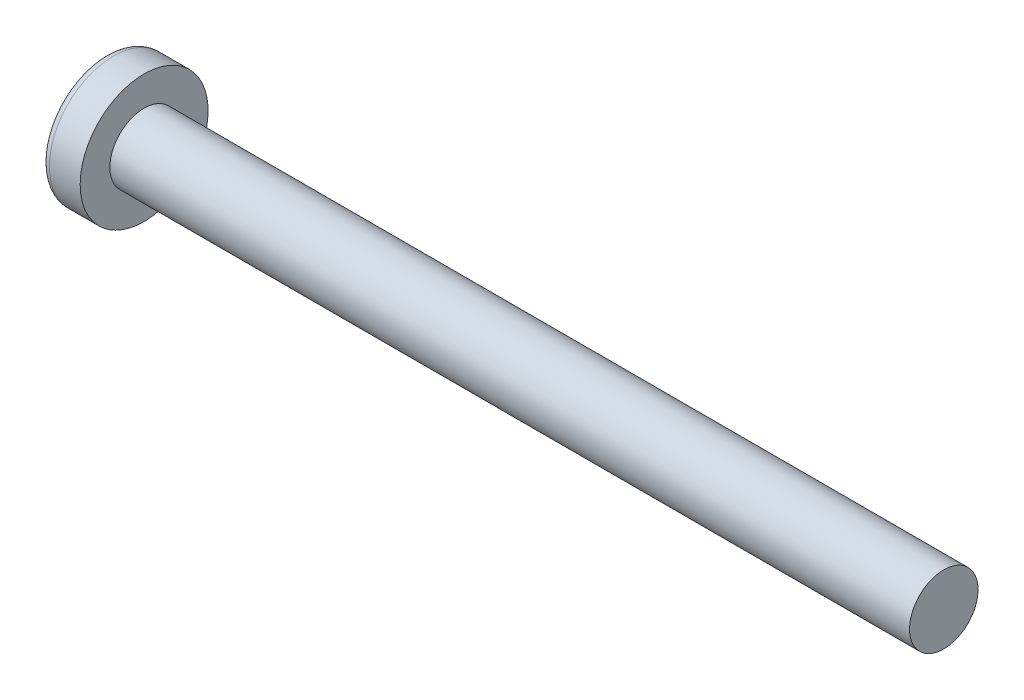
ISO-10303-21;
HEADER;
FILE_DESCRIPTION(('STEP AP214'),'2;1');
FILE_NAME('part.step','',(''),(''),'','','');
FILE_SCHEMA(('AUTOMOTIVE_DESIGN { 1 0 10303 214 1 1 1 1 }'));
ENDSEC;
DATA;
#1=APPLICATION_CONTEXT('core data for automotive mechanical design processes');
#2=APPLICATION_PROTOCOL_DEFINITION('international standard','automotive_design',2000,#1);
#3=PRODUCT_CONTEXT('',#1,'mechanical');
#4=PRODUCT('Part','Part','',(#3));
#5=PRODUCT_RELATED_PRODUCT_CATEGORY('part','',(#4));
#6=PRODUCT_DEFINITION_FORMATION('','',#4);
#7=PRODUCT_DEFINITION_CONTEXT('part definition',#1,'design');
#8=PRODUCT_DEFINITION('design','',#6,#7);
#9=PRODUCT_DEFINITION_SHAPE('','',#8);
#10=(LENGTH_UNIT() NAMED_UNIT(*) SI_UNIT(.MILLI.,.METRE.));
#11=(NAMED_UNIT(*) PLANE_ANGLE_UNIT() SI_UNIT($,.RADIAN.));
#12=(NAMED_UNIT(*) SI_UNIT($,.STERADIAN.) SOLID_ANGLE_UNIT());
#13=UNCERTAINTY_MEASURE_WITH_UNIT(LENGTH_MEASURE(1.E-05),#10,'distance_accuracy_value','');
#14=(GEOMETRIC_REPRESENTATION_CONTEXT(3) GLOBAL_UNCERTAINTY_ASSIGNED_CONTEXT((#13)) GLOBAL_UNIT_ASSIGNED_CONTEXT((#10,
#11,#12)) REPRESENTATION_CONTEXT('',''));
#15=CARTESIAN_POINT('',(0.,0.,0.));
#16=DIRECTION('',(0.,0.,1.));
#17=DIRECTION('',(1.,0.,0.));
#18=AXIS2_PLACEMENT_3D('',#15,#16,#17);
#19=CARTESIAN_POINT('',(5.,0.,0.));
#20=DIRECTION('',(-1.,0.,0.));
#21=DIRECTION('',(0.,1.,0.));
#22=AXIS2_PLACEMENT_3D('',#19,#20,#21);
#23=SPHERICAL_SURFACE('',#22,5.);
#24=CARTESIAN_POINT('',(0.74715070681048,0.,0.));
#25=DIRECTION('',(-1.,0.,0.));
#26=DIRECTION('',(0.,0.,1.));
#27=AXIS2_PLACEMENT_3D('',#24,#25,#26);
#28=CIRCLE('',#27,2.62931034482759);
#29=CARTESIAN_POINT('',(0.74715070681048,0.,2.62931034482759));
#30=VERTEX_POINT('',#29);
#31=EDGE_CURVE('E148',#30,#30,#28,.T.);
#32=ORIENTED_EDGE('',*,*,#31,.T.);
#33=EDGE_LOOP('',(#32));
#34=FACE_BOUND('',#33,.T.);
#35=CARTESIAN_POINT('',(4.98382636322272,-0.153868112043298,0.));
#36=DIRECTION('',(-0.104537710696287,-0.994520923380891,0.));
#37=DIRECTION('',(0.994520923380891,-0.104537710696287,0.));
#38=AXIS2_PLACEMENT_3D('',#35,#36,#37);
#39=CIRCLE('',#38,4.99760572850336);
#40=CARTESIAN_POINT('',(0.188596138461546,0.350175974082162,1.31444652548077));
#41=VERTEX_POINT('',#40);
#42=CARTESIAN_POINT('',(0.0270341343313624,0.367158343834486,0.367158343834487));
#43=VERTEX_POINT('',#42);
#44=EDGE_CURVE('E123',#41,#43,#39,.T.);
#45=ORIENTED_EDGE('',*,*,#44,.F.);
#46=CARTESIAN_POINT('',(3.98403090792016,0.,-1.41352221506761));
#47=DIRECTION('',(0.583636048152575,0.,0.812015371342713));
#48=DIRECTION('',(0.812015371342714,0.,-0.583636048152575));
#49=AXIS2_PLACEMENT_3D('',#46,#47,#48);
#50=CIRCLE('',#49,4.68719124331927);
#51=CARTESIAN_POINT('',(0.188596138461545,-0.350175974082172,1.31444652548076));
#52=VERTEX_POINT('',#51);
#53=EDGE_CURVE('E116',#41,#52,#50,.T.);
#54=ORIENTED_EDGE('',*,*,#53,.T.);
#55=CARTESIAN_POINT('',(4.98382636322272,0.153868112043297,0.));
#56=DIRECTION('',(-0.104537710696287,0.994520923380891,0.));
#57=DIRECTION('',(-0.994520923380891,-0.104537710696287,0.));
#58=AXIS2_PLACEMENT_3D('',#55,#56,#57);
#59=CIRCLE('',#58,4.99760572850336);
#60=CARTESIAN_POINT('',(0.0270341343313616,-0.367158343834489,0.367158343834487));
#61=VERTEX_POINT('',#60);
#62=EDGE_CURVE('E189',#61,#52,#59,.T.);
#63=ORIENTED_EDGE('',*,*,#62,.F.);
#64=CARTESIAN_POINT('',(4.98382636322272,0.,-0.153868112043297));
#65=DIRECTION('',(-0.104537710696287,0.,-0.994520923380891));
#66=DIRECTION('',(-0.994520923380891,0.,0.104537710696287));
#67=AXIS2_PLACEMENT_3D('',#64,#65,#66);
#68=CIRCLE('',#67,4.99760572850336);
#69=CARTESIAN_POINT('',(0.188596138461544,-1.31444652548077,0.350175974082167));
#70=VERTEX_POINT('',#69);
#71=EDGE_CURVE('E164',#70,#61,#68,.T.);
#72=ORIENTED_EDGE('',*,*,#71,.F.);
#73=CARTESIAN_POINT('',(3.98403090792015,1.41352221506761,0.));
#74=DIRECTION('',(0.583636048152575,-0.812015371342713,0.));
#75=DIRECTION('',(0.812015371342714,0.583636048152575,0.));
#76=AXIS2_PLACEMENT_3D('',#73,#74,#75);
#77=CIRCLE('',#76,4.68719124331927);
#78=CARTESIAN_POINT('',(0.188596138461544,-1.31444652548077,-0.350175974082167));
#79=VERTEX_POINT('',#78);
#80=EDGE_CURVE('E160',#70,#79,#77,.T.);
#81=ORIENTED_EDGE('',*,*,#80,.T.);
#82=CARTESIAN_POINT('',(4.98382636322272,0.,0.153868112043297));
#83=DIRECTION('',(-0.104537710696287,0.,0.994520923380891));
#84=DIRECTION('',(0.994520923380891,0.,0.104537710696287));
#85=AXIS2_PLACEMENT_3D('',#82,#83,#84);
#86=CIRCLE('',#85,4.99760572850336);
#87=CARTESIAN_POINT('',(0.0270341343313616,-0.367158343834486,-0.367158343834487));
#88=VERTEX_POINT('',#87);
#89=EDGE_CURVE('E44',#88,#79,#86,.T.);
#90=ORIENTED_EDGE('',*,*,#89,.F.);
#91=CARTESIAN_POINT('',(0.188596138461545,-0.350175974082162,-1.31444652548077));
#92=VERTEX_POINT('',#91);
#93=EDGE_CURVE('E186',#92,#88,#59,.T.);
#94=ORIENTED_EDGE('',*,*,#93,.F.);
#95=CARTESIAN_POINT('',(3.98403090792016,0.,1.41352221506761));
#96=DIRECTION('',(0.583636048152575,0.,-0.812015371342713));
#97=DIRECTION('',(-0.812015371342714,0.,-0.583636048152575));
#98=AXIS2_PLACEMENT_3D('',#95,#96,#97);
#99=CIRCLE('',#98,4.68719124331927);
#100=CARTESIAN_POINT('',(0.188596138461546,0.350175974082172,-1.31444652548076));
#101=VERTEX_POINT('',#100);
#102=EDGE_CURVE('E179',#92,#101,#99,.T.);
#103=ORIENTED_EDGE('',*,*,#102,.T.);
#104=CARTESIAN_POINT('',(0.0270341343313624,0.367158343834489,-0.367158343834487));
#105=VERTEX_POINT('',#104);
#106=EDGE_CURVE('E101',#105,#101,#39,.T.);
#107=ORIENTED_EDGE('',*,*,#106,.F.);
#108=CARTESIAN_POINT('',(0.188596138461546,1.31444652548076,-0.350175974082167));
#109=VERTEX_POINT('',#108);
#110=EDGE_CURVE('E37',#109,#105,#86,.T.);
#111=ORIENTED_EDGE('',*,*,#110,.F.);
#112=CARTESIAN_POINT('',(3.98403090792016,-1.41352221506761,0.));
#113=DIRECTION('',(0.583636048152575,0.812015371342713,0.));
#114=DIRECTION('',(-0.812015371342714,0.583636048152575,0.));
#115=AXIS2_PLACEMENT_3D('',#112,#113,#114);
#116=CIRCLE('',#115,4.68719124331927);
#117=CARTESIAN_POINT('',(0.188596138461546,1.31444652548076,0.350175974082167));
#118=VERTEX_POINT('',#117);
#119=EDGE_CURVE('E11',#109,#118,#116,.T.);
#120=ORIENTED_EDGE('',*,*,#119,.T.);
#121=EDGE_CURVE('E163',#43,#118,#68,.T.);
#122=ORIENTED_EDGE('',*,*,#121,.F.);
#123=EDGE_LOOP('',(#45,#54,#63,#72,#81,#90,#94,#103,#107,#111,#120,#122));
#124=FACE_BOUND('',#123,.T.);
#125=ADVANCED_FACE('F29',(#34,#124),#23,.T.);
#126=CARTESIAN_POINT('',(2.01739130434783,0.,-0.15794466403162));
#127=DIRECTION('',(-0.104537710696287,0.,0.994520923380891));
#128=DIRECTION('',(0.994520923380891,0.,0.104537710696287));
#129=AXIS2_PLACEMENT_3D('',#126,#127,#128);
#130=PLANE('',#129);
#131=ORIENTED_EDGE('',*,*,#110,.T.);
#132=DIRECTION('',(0.989130931836555,-0.103971149085093,0.103971149085092));
#133=VECTOR('',#132,1.);
#134=CARTESIAN_POINT('',(2.03363450411053,0.156237282238383,-0.156237282238382));
#135=LINE('',#134,#133);
#136=CARTESIAN_POINT('',(1.76,0.185000000000001,-0.184999999999999));
#137=VERTEX_POINT('',#136);
#138=EDGE_CURVE('E99',#105,#137,#135,.T.);
#139=ORIENTED_EDGE('',*,*,#138,.T.);
#140=DIRECTION('',(0.80907355338853,-0.581521616498006,0.0850446632823171));
#141=VECTOR('',#140,1.);
#142=CARTESIAN_POINT('',(0.,1.45,-0.37));
#143=LINE('',#142,#141);
#144=EDGE_CURVE('E121',#109,#137,#143,.T.);
#145=ORIENTED_EDGE('',*,*,#144,.F.);
#146=EDGE_LOOP('',(#131,#139,#145));
#147=FACE_BOUND('',#146,.T.);
#148=ADVANCED_FACE('F120',(#147),#130,.T.);
#149=DIRECTION('',(0.80907355338853,0.581521616498006,0.0850446632823171));
#150=VECTOR('',#149,1.);
#151=CARTESIAN_POINT('',(0.,-1.45,-0.37));
#152=LINE('',#151,#150);
#153=CARTESIAN_POINT('',(1.76,-0.185,-0.185));
#154=VERTEX_POINT('',#153);
#155=EDGE_CURVE('E142',#79,#154,#152,.T.);
#156=ORIENTED_EDGE('',*,*,#155,.T.);
#157=DIRECTION('',(-0.989130931836555,-0.103971149085092,-0.103971149085092));
#158=VECTOR('',#157,1.);
#159=CARTESIAN_POINT('',(2.03363450411053,-0.156237282238382,-0.156237282238382));
#160=LINE('',#159,#158);
#161=EDGE_CURVE('E187',#154,#88,#160,.T.);
#162=ORIENTED_EDGE('',*,*,#161,.T.);
#163=ORIENTED_EDGE('',*,*,#89,.T.);
#164=EDGE_LOOP('',(#156,#162,#163));
#165=FACE_BOUND('',#164,.T.);
#166=ADVANCED_FACE('F220',(#165),#130,.T.);
#167=CARTESIAN_POINT('',(2.01739130434783,0.,0.157944664031621));
#168=DIRECTION('',(-0.104537710696287,0.,-0.994520923380891));
#169=DIRECTION('',(-0.994520923380891,0.,0.104537710696287));
#170=AXIS2_PLACEMENT_3D('',#167,#168,#169);
#171=PLANE('',#170);
#172=DIRECTION('',(0.80907355338853,-0.581521616498006,-0.085044663282317));
#173=VECTOR('',#172,1.);
#174=CARTESIAN_POINT('',(0.,1.45,0.37));
#175=LINE('',#174,#173);
#176=CARTESIAN_POINT('',(1.76,0.185,0.185));
#177=VERTEX_POINT('',#176);
#178=EDGE_CURVE('E128',#118,#177,#175,.T.);
#179=ORIENTED_EDGE('',*,*,#178,.T.);
#180=DIRECTION('',(-0.989130931836555,0.103971149085092,0.103971149085092));
#181=VECTOR('',#180,1.);
#182=CARTESIAN_POINT('',(2.03363450411053,0.156237282238382,0.156237282238382));
#183=LINE('',#182,#181);
#184=EDGE_CURVE('E175',#177,#43,#183,.T.);
#185=ORIENTED_EDGE('',*,*,#184,.T.);
#186=ORIENTED_EDGE('',*,*,#121,.T.);
#187=EDGE_LOOP('',(#179,#185,#186));
#188=FACE_BOUND('',#187,.T.);
#189=ADVANCED_FACE('F173',(#188),#171,.T.);
#190=ORIENTED_EDGE('',*,*,#71,.T.);
#191=DIRECTION('',(0.989130931836555,0.103971149085093,-0.103971149085092));
#192=VECTOR('',#191,1.);
#193=CARTESIAN_POINT('',(2.03363450411053,-0.156237282238383,0.156237282238382));
#194=LINE('',#193,#192);
#195=CARTESIAN_POINT('',(1.76,-0.185000000000001,0.184999999999999));
#196=VERTEX_POINT('',#195);
#197=EDGE_CURVE('E192',#61,#196,#194,.T.);
#198=ORIENTED_EDGE('',*,*,#197,.T.);
#199=DIRECTION('',(0.80907355338853,0.581521616498006,-0.0850446632823169));
#200=VECTOR('',#199,1.);
#201=CARTESIAN_POINT('',(0.,-1.45,0.37));
#202=LINE('',#201,#200);
#203=EDGE_CURVE('E139',#70,#196,#202,.T.);
#204=ORIENTED_EDGE('',*,*,#203,.F.);
#205=EDGE_LOOP('',(#190,#198,#204));
#206=FACE_BOUND('',#205,.T.);
#207=ADVANCED_FACE('F239',(#206),#171,.T.);
#208=CARTESIAN_POINT('',(-25.4,0.,0.));
#209=DIRECTION('',(-1.,0.,0.));
#210=DIRECTION('',(0.,0.,1.));
#211=AXIS2_PLACEMENT_3D('',#208,#209,#210);
#212=CYLINDRICAL_SURFACE('',#211,1.5);
#213=CARTESIAN_POINT('',(37.4,0.,0.));
#214=DIRECTION('',(-1.,0.,0.));
#215=DIRECTION('',(0.,0.,1.));
#216=AXIS2_PLACEMENT_3D('',#213,#214,#215);
#217=CIRCLE('',#216,1.5);
#218=CARTESIAN_POINT('',(37.4,0.,1.5));
#219=VERTEX_POINT('',#218);
#220=EDGE_CURVE('E127',#219,#219,#217,.T.);
#221=ORIENTED_EDGE('',*,*,#220,.T.);
#222=EDGE_LOOP('',(#221));
#223=FACE_BOUND('',#222,.T.);
#224=CARTESIAN_POINT('',(2.4,0.,0.));
#225=DIRECTION('',(-1.,0.,0.));
#226=DIRECTION('',(0.,0.,1.));
#227=AXIS2_PLACEMENT_3D('',#224,#225,#226);
#228=CIRCLE('',#227,1.5);
#229=CARTESIAN_POINT('',(2.4,0.,1.5));
#230=VERTEX_POINT('',#229);
#231=EDGE_CURVE('E157',#230,#230,#228,.T.);
#232=ORIENTED_EDGE('',*,*,#231,.F.);
#233=EDGE_LOOP('',(#232));
#234=FACE_BOUND('',#233,.T.);
#235=ADVANCED_FACE('F31',(#223,#234),#212,.T.);
#236=CARTESIAN_POINT('',(2.4,1.5,0.));
#237=DIRECTION('',(-1.,0.,0.));
#238=DIRECTION('',(0.,0.,1.));
#239=AXIS2_PLACEMENT_3D('',#236,#237,#238);
#240=PLANE('',#239);
#241=CARTESIAN_POINT('',(2.4,0.,0.));
#242=DIRECTION('',(-1.,0.,0.));
#243=DIRECTION('',(0.,0.,1.));
#244=AXIS2_PLACEMENT_3D('',#241,#242,#243);
#245=CIRCLE('',#244,2.8);
#246=CARTESIAN_POINT('',(2.4,0.,2.8));
#247=VERTEX_POINT('',#246);
#248=EDGE_CURVE('E154',#247,#247,#245,.T.);
#249=ORIENTED_EDGE('',*,*,#248,.F.);
#250=EDGE_LOOP('',(#249));
#251=FACE_BOUND('',#250,.T.);
#252=ORIENTED_EDGE('',*,*,#231,.T.);
#253=EDGE_LOOP('',(#252));
#254=FACE_BOUND('',#253,.T.);
#255=ADVANCED_FACE('F232',(#251,#254),#240,.F.);
#256=CARTESIAN_POINT('',(-25.4,0.,0.));
#257=DIRECTION('',(-1.,0.,0.));
#258=DIRECTION('',(0.,0.,1.));
#259=AXIS2_PLACEMENT_3D('',#256,#257,#258);
#260=CYLINDRICAL_SURFACE('',#259,2.8);
#261=ORIENTED_EDGE('',*,*,#248,.T.);
#262=EDGE_LOOP('',(#261));
#263=FACE_BOUND('',#262,.T.);
#264=CARTESIAN_POINT('',(1.05335585592013,0.,0.));
#265=DIRECTION('',(-1.,0.,0.));
#266=DIRECTION('',(0.,0.,1.));
#267=AXIS2_PLACEMENT_3D('',#264,#265,#266);
#268=CIRCLE('',#267,2.8);
#269=CARTESIAN_POINT('',(1.05335585592013,0.,2.8));
#270=VERTEX_POINT('',#269);
#271=EDGE_CURVE('E151',#270,#270,#268,.T.);
#272=ORIENTED_EDGE('',*,*,#271,.F.);
#273=EDGE_LOOP('',(#272));
#274=FACE_BOUND('',#273,.T.);
#275=ADVANCED_FACE('F229',(#263,#274),#260,.T.);
#276=CARTESIAN_POINT('',(1.05335585592013,0.,0.));
#277=DIRECTION('',(-1.,0.,0.));
#278=DIRECTION('',(0.,0.,1.));
#279=AXIS2_PLACEMENT_3D('',#276,#277,#278);
#280=TOROIDAL_SURFACE('',#279,2.44,0.36);
#281=ORIENTED_EDGE('',*,*,#271,.T.);
#282=EDGE_LOOP('',(#281));
#283=FACE_BOUND('',#282,.T.);
#284=ORIENTED_EDGE('',*,*,#31,.F.);
#285=EDGE_LOOP('',(#284));
#286=FACE_BOUND('',#285,.T.);
#287=ADVANCED_FACE('F226',(#283,#286),#280,.T.);
#288=CARTESIAN_POINT('',(37.4,1.5,0.));
#289=DIRECTION('',(1.,0.,0.));
#290=DIRECTION('',(0.,0.,-1.));
#291=AXIS2_PLACEMENT_3D('',#288,#289,#290);
#292=PLANE('',#291);
#293=ORIENTED_EDGE('',*,*,#220,.F.);
#294=EDGE_LOOP('',(#293));
#295=FACE_BOUND('',#294,.T.);
#296=ADVANCED_FACE('F224',(#295),#292,.T.);
#297=CARTESIAN_POINT('',(1.76,0.185,0.185));
#298=DIRECTION('',(0.583636048152575,0.812015371342713,0.));
#299=DIRECTION('',(-0.812015371342714,0.583636048152575,0.));
#300=AXIS2_PLACEMENT_3D('',#297,#298,#299);
#301=PLANE('',#300);
#302=ORIENTED_EDGE('',*,*,#144,.T.);
#303=DIRECTION('',(0.,0.,-1.));
#304=VECTOR('',#303,1.);
#305=CARTESIAN_POINT('',(1.76,0.185,0.185));
#306=LINE('',#305,#304);
#307=EDGE_CURVE('E115',#177,#137,#306,.T.);
#308=ORIENTED_EDGE('',*,*,#307,.F.);
#309=ORIENTED_EDGE('',*,*,#178,.F.);
#310=ORIENTED_EDGE('',*,*,#119,.F.);
#311=EDGE_LOOP('',(#302,#308,#309,#310));
#312=FACE_BOUND('',#311,.T.);
#313=ADVANCED_FACE('F126',(#312),#301,.F.);
#314=CARTESIAN_POINT('',(1.76,-0.185,-0.185));
#315=DIRECTION('',(0.583636048152575,-0.812015371342713,0.));
#316=DIRECTION('',(0.812015371342714,0.583636048152575,0.));
#317=AXIS2_PLACEMENT_3D('',#314,#315,#316);
#318=PLANE('',#317);
#319=ORIENTED_EDGE('',*,*,#203,.T.);
#320=DIRECTION('',(0.,0.,1.));
#321=VECTOR('',#320,1.);
#322=CARTESIAN_POINT('',(1.76,-0.185,-0.185));
#323=LINE('',#322,#321);
#324=EDGE_CURVE('E135',#154,#196,#323,.T.);
#325=ORIENTED_EDGE('',*,*,#324,.F.);
#326=ORIENTED_EDGE('',*,*,#155,.F.);
#327=ORIENTED_EDGE('',*,*,#80,.F.);
#328=EDGE_LOOP('',(#319,#325,#326,#327));
#329=FACE_BOUND('',#328,.T.);
#330=ADVANCED_FACE('F259',(#329),#318,.F.);
#331=CARTESIAN_POINT('',(1.76,-0.185,-0.185));
#332=DIRECTION('',(1.,0.,0.));
#333=DIRECTION('',(0.,0.,-1.));
#334=AXIS2_PLACEMENT_3D('',#331,#332,#333);
#335=PLANE('',#334);
#336=DIRECTION('',(0.,1.,0.));
#337=VECTOR('',#336,1.);
#338=CARTESIAN_POINT('',(1.76,-0.185,-0.185));
#339=LINE('',#338,#337);
#340=EDGE_CURVE('E108',#154,#137,#339,.T.);
#341=ORIENTED_EDGE('',*,*,#340,.F.);
#342=ORIENTED_EDGE('',*,*,#324,.T.);
#343=DIRECTION('',(0.,-1.,0.));
#344=VECTOR('',#343,1.);
#345=CARTESIAN_POINT('',(1.76,0.185,0.185));
#346=LINE('',#345,#344);
#347=EDGE_CURVE('E133',#177,#196,#346,.T.);
#348=ORIENTED_EDGE('',*,*,#347,.F.);
#349=ORIENTED_EDGE('',*,*,#307,.T.);
#350=EDGE_LOOP('',(#341,#342,#348,#349));
#351=FACE_BOUND('',#350,.T.);
#352=ADVANCED_FACE('F131',(#351),#335,.F.);
#353=CARTESIAN_POINT('',(1.76,0.185000000000001,-0.184999999999999));
#354=DIRECTION('',(0.583636048152575,0.,-0.812015371342713));
#355=DIRECTION('',(0.812015371342714,0.,0.583636048152575));
#356=AXIS2_PLACEMENT_3D('',#353,#354,#355);
#357=PLANE('',#356);
#358=DIRECTION('',(0.80907355338853,0.0850446632823149,0.581521616498006));
#359=VECTOR('',#358,1.);
#360=CARTESIAN_POINT('',(0.,-0.369999999999994,-1.45));
#361=LINE('',#360,#359);
#362=EDGE_CURVE('E105',#92,#154,#361,.T.);
#363=ORIENTED_EDGE('',*,*,#362,.T.);
#364=ORIENTED_EDGE('',*,*,#340,.T.);
#365=DIRECTION('',(0.80907355338853,-0.0850446632823191,0.581521616498006));
#366=VECTOR('',#365,1.);
#367=CARTESIAN_POINT('',(0.,0.370000000000005,-1.45));
#368=LINE('',#367,#366);
#369=EDGE_CURVE('E95',#101,#137,#368,.T.);
#370=ORIENTED_EDGE('',*,*,#369,.F.);
#371=ORIENTED_EDGE('',*,*,#102,.F.);
#372=EDGE_LOOP('',(#363,#364,#370,#371));
#373=FACE_BOUND('',#372,.T.);
#374=ADVANCED_FACE('F109',(#373),#357,.F.);
#375=CARTESIAN_POINT('',(2.01739130434783,-0.157944664031621,0.));
#376=DIRECTION('',(-0.104537710696287,0.994520923380891,0.));
#377=DIRECTION('',(-0.994520923380891,-0.104537710696287,0.));
#378=AXIS2_PLACEMENT_3D('',#375,#376,#377);
#379=PLANE('',#378);
#380=ORIENTED_EDGE('',*,*,#93,.T.);
#381=ORIENTED_EDGE('',*,*,#161,.F.);
#382=ORIENTED_EDGE('',*,*,#362,.F.);
#383=EDGE_LOOP('',(#380,#381,#382));
#384=FACE_BOUND('',#383,.T.);
#385=ADVANCED_FACE('F211',(#384),#379,.T.);
#386=CARTESIAN_POINT('',(2.01739130434783,0.15794466403162,0.));
#387=DIRECTION('',(-0.104537710696287,-0.994520923380891,0.));
#388=DIRECTION('',(0.994520923380891,-0.104537710696287,0.));
#389=AXIS2_PLACEMENT_3D('',#386,#387,#388);
#390=PLANE('',#389);
#391=ORIENTED_EDGE('',*,*,#106,.T.);
#392=ORIENTED_EDGE('',*,*,#369,.T.);
#393=ORIENTED_EDGE('',*,*,#138,.F.);
#394=EDGE_LOOP('',(#391,#392,#393));
#395=FACE_BOUND('',#394,.T.);
#396=ADVANCED_FACE('F97',(#395),#390,.T.);
#397=CARTESIAN_POINT('',(1.76,-0.185000000000001,0.184999999999999));
#398=DIRECTION('',(0.583636048152575,0.,0.812015371342713));
#399=DIRECTION('',(-0.812015371342714,0.,0.583636048152575));
#400=AXIS2_PLACEMENT_3D('',#397,#398,#399);
#401=PLANE('',#400);
#402=DIRECTION('',(0.80907355338853,-0.0850446632823151,-0.581521616498006));
#403=VECTOR('',#402,1.);
#404=CARTESIAN_POINT('',(0.,0.369999999999995,1.45));
#405=LINE('',#404,#403);
#406=EDGE_CURVE('E195',#41,#177,#405,.T.);
#407=ORIENTED_EDGE('',*,*,#406,.T.);
#408=ORIENTED_EDGE('',*,*,#347,.T.);
#409=DIRECTION('',(0.80907355338853,0.085044663282319,-0.581521616498006));
#410=VECTOR('',#409,1.);
#411=CARTESIAN_POINT('',(0.,-0.370000000000005,1.45));
#412=LINE('',#411,#410);
#413=EDGE_CURVE('E104',#52,#196,#412,.T.);
#414=ORIENTED_EDGE('',*,*,#413,.F.);
#415=ORIENTED_EDGE('',*,*,#53,.F.);
#416=EDGE_LOOP('',(#407,#408,#414,#415));
#417=FACE_BOUND('',#416,.T.);
#418=ADVANCED_FACE('F199',(#417),#401,.F.);
#419=ORIENTED_EDGE('',*,*,#44,.T.);
#420=ORIENTED_EDGE('',*,*,#184,.F.);
#421=ORIENTED_EDGE('',*,*,#406,.F.);
#422=EDGE_LOOP('',(#419,#420,#421));
#423=FACE_BOUND('',#422,.T.);
#424=ADVANCED_FACE('F201',(#423),#390,.T.);
#425=ORIENTED_EDGE('',*,*,#62,.T.);
#426=ORIENTED_EDGE('',*,*,#413,.T.);
#427=ORIENTED_EDGE('',*,*,#197,.F.);
#428=EDGE_LOOP('',(#425,#426,#427));
#429=FACE_BOUND('',#428,.T.);
#430=ADVANCED_FACE('F203',(#429),#379,.T.);
#431=CLOSED_SHELL('',(#125,#148,#166,#189,#207,#235,#255,#275,#287,#296,#313,#330,#352,#374,
#385,#396,#418,#424,#430));
#432=MANIFOLD_SOLID_BREP('B2',#431);
#433=ADVANCED_BREP_SHAPE_REPRESENTATION('',(#18,#432),#14);
#434=SHAPE_DEFINITION_REPRESENTATION(#9,#433);
ENDSEC;
END-ISO-10303-21;
